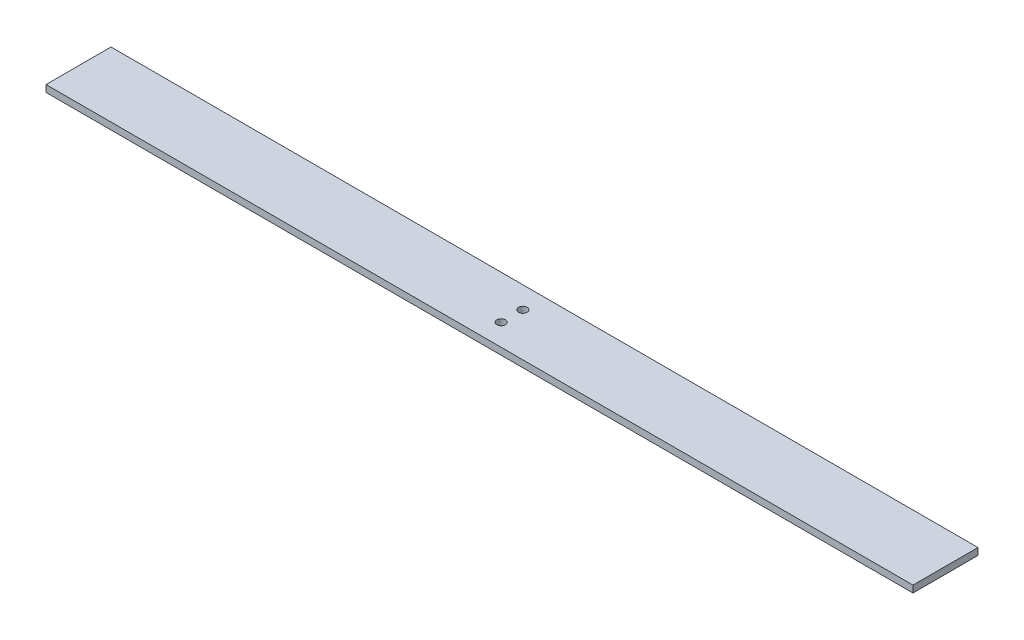
ISO-10303-21;
HEADER;
FILE_DESCRIPTION(('STEP AP214'),'2;1');
FILE_NAME('part.step','',(''),(''),'','','');
FILE_SCHEMA(('AUTOMOTIVE_DESIGN { 1 0 10303 214 1 1 1 1 }'));
ENDSEC;
DATA;
#1=APPLICATION_CONTEXT('core data for automotive mechanical design processes');
#2=APPLICATION_PROTOCOL_DEFINITION('international standard','automotive_design',2000,#1);
#3=PRODUCT_CONTEXT('',#1,'mechanical');
#4=PRODUCT('Part','Part','',(#3));
#5=PRODUCT_RELATED_PRODUCT_CATEGORY('part','',(#4));
#6=PRODUCT_DEFINITION_FORMATION('','',#4);
#7=PRODUCT_DEFINITION_CONTEXT('part definition',#1,'design');
#8=PRODUCT_DEFINITION('design','',#6,#7);
#9=PRODUCT_DEFINITION_SHAPE('','',#8);
#10=(LENGTH_UNIT() NAMED_UNIT(*) SI_UNIT(.MILLI.,.METRE.));
#11=(NAMED_UNIT(*) PLANE_ANGLE_UNIT() SI_UNIT($,.RADIAN.));
#12=(NAMED_UNIT(*) SI_UNIT($,.STERADIAN.) SOLID_ANGLE_UNIT());
#13=UNCERTAINTY_MEASURE_WITH_UNIT(LENGTH_MEASURE(1.E-05),#10,'distance_accuracy_value','');
#14=(GEOMETRIC_REPRESENTATION_CONTEXT(3) GLOBAL_UNCERTAINTY_ASSIGNED_CONTEXT((#13)) GLOBAL_UNIT_ASSIGNED_CONTEXT((#10,
#11,#12)) REPRESENTATION_CONTEXT('',''));
#15=CARTESIAN_POINT('',(0.,0.,0.));
#16=DIRECTION('',(0.,0.,1.));
#17=DIRECTION('',(1.,0.,0.));
#18=AXIS2_PLACEMENT_3D('',#15,#16,#17);
#19=CARTESIAN_POINT('',(-175.947131352674,3.175,-39.698962692325));
#20=DIRECTION('',(1.,0.,0.));
#21=DIRECTION('',(0.,0.,-1.));
#22=AXIS2_PLACEMENT_3D('',#19,#20,#21);
#23=PLANE('',#22);
#24=DIRECTION('',(0.,0.,1.));
#25=VECTOR('',#24,1.);
#26=CARTESIAN_POINT('',(-175.947131352674,0.,-39.698962692325));
#27=LINE('',#26,#25);
#28=CARTESIAN_POINT('',(-175.947131352674,0.,-39.698962692325));
#29=VERTEX_POINT('',#28);
#30=CARTESIAN_POINT('',(-175.947131352674,0.,-9.69896269232497));
#31=VERTEX_POINT('',#30);
#32=EDGE_CURVE('E96',#29,#31,#27,.T.);
#33=ORIENTED_EDGE('',*,*,#32,.T.);
#34=DIRECTION('',(0.,-1.,0.));
#35=VECTOR('',#34,1.);
#36=CARTESIAN_POINT('',(-175.947131352674,3.175,-9.69896269232497));
#37=LINE('',#36,#35);
#38=CARTESIAN_POINT('',(-175.947131352674,3.175,-9.69896269232497));
#39=VERTEX_POINT('',#38);
#40=EDGE_CURVE('E11',#39,#31,#37,.T.);
#41=ORIENTED_EDGE('',*,*,#40,.F.);
#42=DIRECTION('',(0.,0.,1.));
#43=VECTOR('',#42,1.);
#44=CARTESIAN_POINT('',(-175.947131352674,3.175,-39.698962692325));
#45=LINE('',#44,#43);
#46=CARTESIAN_POINT('',(-175.947131352674,3.175,-39.698962692325));
#47=VERTEX_POINT('',#46);
#48=EDGE_CURVE('E84',#47,#39,#45,.T.);
#49=ORIENTED_EDGE('',*,*,#48,.F.);
#50=DIRECTION('',(0.,-1.,0.));
#51=VECTOR('',#50,1.);
#52=CARTESIAN_POINT('',(-175.947131352674,3.175,-39.698962692325));
#53=LINE('',#52,#51);
#54=EDGE_CURVE('E92',#47,#29,#53,.T.);
#55=ORIENTED_EDGE('',*,*,#54,.T.);
#56=EDGE_LOOP('',(#33,#41,#49,#55));
#57=FACE_BOUND('',#56,.T.);
#58=ADVANCED_FACE('F33',(#57),#23,.F.);
#59=CARTESIAN_POINT('',(-175.947131352674,3.175,-9.69896269232497));
#60=DIRECTION('',(0.,0.,-1.));
#61=DIRECTION('',(-1.,0.,0.));
#62=AXIS2_PLACEMENT_3D('',#59,#60,#61);
#63=PLANE('',#62);
#64=DIRECTION('',(1.,0.,0.));
#65=VECTOR('',#64,1.);
#66=CARTESIAN_POINT('',(-175.947131352674,0.,-9.69896269232497));
#67=LINE('',#66,#65);
#68=CARTESIAN_POINT('',(224.052868647326,0.,-9.69896269232497));
#69=VERTEX_POINT('',#68);
#70=EDGE_CURVE('E88',#31,#69,#67,.T.);
#71=ORIENTED_EDGE('',*,*,#70,.T.);
#72=DIRECTION('',(0.,-1.,0.));
#73=VECTOR('',#72,1.);
#74=CARTESIAN_POINT('',(224.052868647326,3.175,-9.69896269232497));
#75=LINE('',#74,#73);
#76=CARTESIAN_POINT('',(224.052868647326,3.175,-9.69896269232497));
#77=VERTEX_POINT('',#76);
#78=EDGE_CURVE('E41',#77,#69,#75,.T.);
#79=ORIENTED_EDGE('',*,*,#78,.F.);
#80=DIRECTION('',(1.,0.,0.));
#81=VECTOR('',#80,1.);
#82=CARTESIAN_POINT('',(-175.947131352674,3.175,-9.69896269232497));
#83=LINE('',#82,#81);
#84=EDGE_CURVE('E79',#39,#77,#83,.T.);
#85=ORIENTED_EDGE('',*,*,#84,.F.);
#86=ORIENTED_EDGE('',*,*,#40,.T.);
#87=EDGE_LOOP('',(#71,#79,#85,#86));
#88=FACE_BOUND('',#87,.T.);
#89=ADVANCED_FACE('F87',(#88),#63,.F.);
#90=CARTESIAN_POINT('',(224.052868647326,3.175,-39.698962692325));
#91=DIRECTION('',(-1.,0.,0.));
#92=DIRECTION('',(0.,0.,1.));
#93=AXIS2_PLACEMENT_3D('',#90,#91,#92);
#94=PLANE('',#93);
#95=DIRECTION('',(0.,0.,-1.));
#96=VECTOR('',#95,1.);
#97=CARTESIAN_POINT('',(224.052868647326,0.,-39.698962692325));
#98=LINE('',#97,#96);
#99=CARTESIAN_POINT('',(224.052868647326,0.,-39.698962692325));
#100=VERTEX_POINT('',#99);
#101=EDGE_CURVE('E66',#69,#100,#98,.T.);
#102=ORIENTED_EDGE('',*,*,#101,.T.);
#103=DIRECTION('',(0.,-1.,0.));
#104=VECTOR('',#103,1.);
#105=CARTESIAN_POINT('',(224.052868647326,3.175,-39.698962692325));
#106=LINE('',#105,#104);
#107=CARTESIAN_POINT('',(224.052868647326,3.175,-39.698962692325));
#108=VERTEX_POINT('',#107);
#109=EDGE_CURVE('E89',#108,#100,#106,.T.);
#110=ORIENTED_EDGE('',*,*,#109,.F.);
#111=DIRECTION('',(0.,0.,-1.));
#112=VECTOR('',#111,1.);
#113=CARTESIAN_POINT('',(224.052868647326,3.175,-39.698962692325));
#114=LINE('',#113,#112);
#115=EDGE_CURVE('E82',#77,#108,#114,.T.);
#116=ORIENTED_EDGE('',*,*,#115,.F.);
#117=ORIENTED_EDGE('',*,*,#78,.T.);
#118=EDGE_LOOP('',(#102,#110,#116,#117));
#119=FACE_BOUND('',#118,.T.);
#120=ADVANCED_FACE('F90',(#119),#94,.F.);
#121=CARTESIAN_POINT('',(-175.947131352674,3.175,-39.698962692325));
#122=DIRECTION('',(0.,0.,1.));
#123=DIRECTION('',(1.,0.,0.));
#124=AXIS2_PLACEMENT_3D('',#121,#122,#123);
#125=PLANE('',#124);
#126=DIRECTION('',(-1.,0.,0.));
#127=VECTOR('',#126,1.);
#128=CARTESIAN_POINT('',(-175.947131352674,0.,-39.698962692325));
#129=LINE('',#128,#127);
#130=EDGE_CURVE('E72',#100,#29,#129,.T.);
#131=ORIENTED_EDGE('',*,*,#130,.T.);
#132=ORIENTED_EDGE('',*,*,#54,.F.);
#133=DIRECTION('',(-1.,0.,0.));
#134=VECTOR('',#133,1.);
#135=CARTESIAN_POINT('',(-175.947131352674,3.175,-39.698962692325));
#136=LINE('',#135,#134);
#137=EDGE_CURVE('E49',#108,#47,#136,.T.);
#138=ORIENTED_EDGE('',*,*,#137,.F.);
#139=ORIENTED_EDGE('',*,*,#109,.T.);
#140=EDGE_LOOP('',(#131,#132,#138,#139));
#141=FACE_BOUND('',#140,.T.);
#142=ADVANCED_FACE('F104',(#141),#125,.F.);
#143=CARTESIAN_POINT('',(0.,3.175,0.));
#144=DIRECTION('',(0.,1.,0.));
#145=DIRECTION('',(0.,0.,1.));
#146=AXIS2_PLACEMENT_3D('',#143,#144,#145);
#147=PLANE('',#146);
#148=CARTESIAN_POINT('',(24.0528686473259,3.175,-19.698962692325));
#149=DIRECTION('',(0.,1.,0.));
#150=DIRECTION('',(0.,0.,1.));
#151=AXIS2_PLACEMENT_3D('',#148,#149,#150);
#152=CIRCLE('',#151,2.00000000000001);
#153=CARTESIAN_POINT('',(24.0528686473259,3.175,-17.698962692325));
#154=VERTEX_POINT('',#153);
#155=EDGE_CURVE('E116',#154,#154,#152,.T.);
#156=ORIENTED_EDGE('',*,*,#155,.F.);
#157=EDGE_LOOP('',(#156));
#158=FACE_BOUND('',#157,.T.);
#159=CARTESIAN_POINT('',(24.052868647326,3.175,-29.698962692325));
#160=DIRECTION('',(0.,1.,0.));
#161=DIRECTION('',(0.,0.,1.));
#162=AXIS2_PLACEMENT_3D('',#159,#160,#161);
#163=CIRCLE('',#162,2.00000000000001);
#164=CARTESIAN_POINT('',(24.052868647326,3.175,-27.698962692325));
#165=VERTEX_POINT('',#164);
#166=EDGE_CURVE('E110',#165,#165,#163,.T.);
#167=ORIENTED_EDGE('',*,*,#166,.F.);
#168=EDGE_LOOP('',(#167));
#169=FACE_BOUND('',#168,.T.);
#170=ORIENTED_EDGE('',*,*,#48,.T.);
#171=ORIENTED_EDGE('',*,*,#84,.T.);
#172=ORIENTED_EDGE('',*,*,#115,.T.);
#173=ORIENTED_EDGE('',*,*,#137,.T.);
#174=EDGE_LOOP('',(#170,#171,#172,#173));
#175=FACE_BOUND('',#174,.T.);
#176=ADVANCED_FACE('F80',(#158,#169,#175),#147,.T.);
#177=CARTESIAN_POINT('',(0.,0.,0.));
#178=DIRECTION('',(0.,1.,0.));
#179=DIRECTION('',(0.,0.,1.));
#180=AXIS2_PLACEMENT_3D('',#177,#178,#179);
#181=PLANE('',#180);
#182=CARTESIAN_POINT('',(24.0528686473259,0.,-19.698962692325));
#183=DIRECTION('',(0.,1.,0.));
#184=DIRECTION('',(0.,0.,1.));
#185=AXIS2_PLACEMENT_3D('',#182,#183,#184);
#186=CIRCLE('',#185,2.00000000000001);
#187=CARTESIAN_POINT('',(24.0528686473259,0.,-17.698962692325));
#188=VERTEX_POINT('',#187);
#189=EDGE_CURVE('E113',#188,#188,#186,.T.);
#190=ORIENTED_EDGE('',*,*,#189,.T.);
#191=EDGE_LOOP('',(#190));
#192=FACE_BOUND('',#191,.T.);
#193=CARTESIAN_POINT('',(24.052868647326,0.,-29.698962692325));
#194=DIRECTION('',(0.,1.,0.));
#195=DIRECTION('',(0.,0.,1.));
#196=AXIS2_PLACEMENT_3D('',#193,#194,#195);
#197=CIRCLE('',#196,2.00000000000001);
#198=CARTESIAN_POINT('',(24.052868647326,0.,-27.698962692325));
#199=VERTEX_POINT('',#198);
#200=EDGE_CURVE('E99',#199,#199,#197,.T.);
#201=ORIENTED_EDGE('',*,*,#200,.T.);
#202=EDGE_LOOP('',(#201));
#203=FACE_BOUND('',#202,.T.);
#204=ORIENTED_EDGE('',*,*,#32,.F.);
#205=ORIENTED_EDGE('',*,*,#130,.F.);
#206=ORIENTED_EDGE('',*,*,#101,.F.);
#207=ORIENTED_EDGE('',*,*,#70,.F.);
#208=EDGE_LOOP('',(#204,#205,#206,#207));
#209=FACE_BOUND('',#208,.T.);
#210=ADVANCED_FACE('F107',(#192,#203,#209),#181,.F.);
#211=CARTESIAN_POINT('',(24.052868647326,0.,-29.698962692325));
#212=DIRECTION('',(0.,1.,0.));
#213=DIRECTION('',(0.,0.,1.));
#214=AXIS2_PLACEMENT_3D('',#211,#212,#213);
#215=CYLINDRICAL_SURFACE('',#214,2.00000000000001);
#216=ORIENTED_EDGE('',*,*,#200,.F.);
#217=EDGE_LOOP('',(#216));
#218=FACE_BOUND('',#217,.T.);
#219=ORIENTED_EDGE('',*,*,#166,.T.);
#220=EDGE_LOOP('',(#219));
#221=FACE_BOUND('',#220,.T.);
#222=ADVANCED_FACE('F127',(#218,#221),#215,.F.);
#223=CARTESIAN_POINT('',(24.0528686473259,0.,-19.698962692325));
#224=DIRECTION('',(0.,1.,0.));
#225=DIRECTION('',(0.,0.,1.));
#226=AXIS2_PLACEMENT_3D('',#223,#224,#225);
#227=CYLINDRICAL_SURFACE('',#226,2.00000000000001);
#228=ORIENTED_EDGE('',*,*,#189,.F.);
#229=EDGE_LOOP('',(#228));
#230=FACE_BOUND('',#229,.T.);
#231=ORIENTED_EDGE('',*,*,#155,.T.);
#232=EDGE_LOOP('',(#231));
#233=FACE_BOUND('',#232,.T.);
#234=ADVANCED_FACE('F124',(#230,#233),#227,.F.);
#235=CLOSED_SHELL('',(#58,#89,#120,#142,#176,#210,#222,#234));
#236=MANIFOLD_SOLID_BREP('B2',#235);
#237=ADVANCED_BREP_SHAPE_REPRESENTATION('',(#18,#236),#14);
#238=SHAPE_DEFINITION_REPRESENTATION(#9,#237);
ENDSEC;
END-ISO-10303-21;
